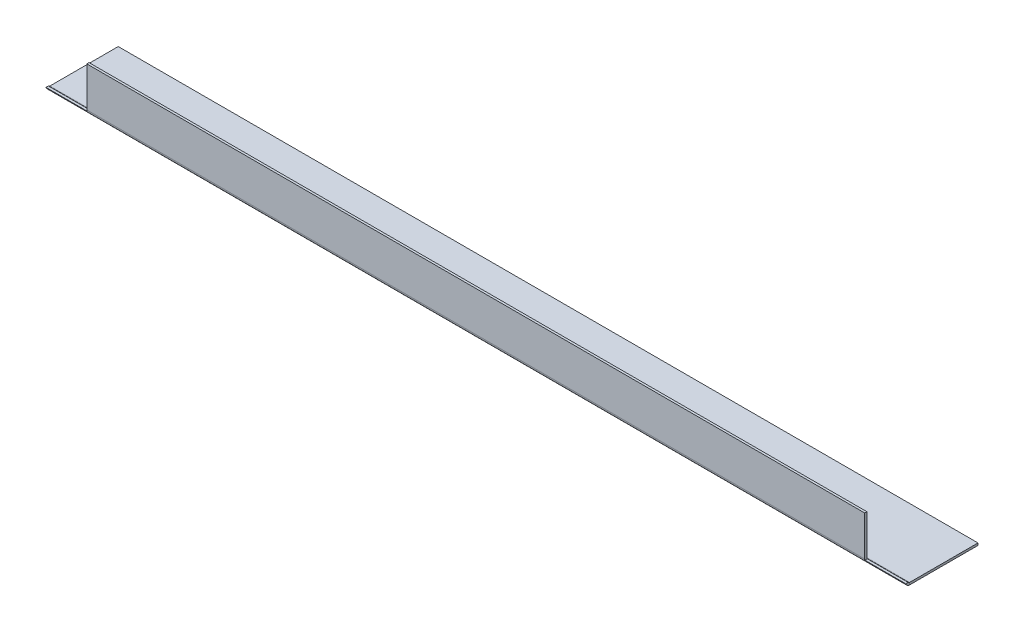
ISO-10303-21;
HEADER;
FILE_DESCRIPTION(('STEP AP214'),'2;1');
FILE_NAME('part.step','',(''),(''),'','','');
FILE_SCHEMA(('AUTOMOTIVE_DESIGN { 1 0 10303 214 1 1 1 1 }'));
ENDSEC;
DATA;
#1=APPLICATION_CONTEXT('core data for automotive mechanical design processes');
#2=APPLICATION_PROTOCOL_DEFINITION('international standard','automotive_design',2000,#1);
#3=PRODUCT_CONTEXT('',#1,'mechanical');
#4=PRODUCT('Part','Part','',(#3));
#5=PRODUCT_RELATED_PRODUCT_CATEGORY('part','',(#4));
#6=PRODUCT_DEFINITION_FORMATION('','',#4);
#7=PRODUCT_DEFINITION_CONTEXT('part definition',#1,'design');
#8=PRODUCT_DEFINITION('design','',#6,#7);
#9=PRODUCT_DEFINITION_SHAPE('','',#8);
#10=(LENGTH_UNIT() NAMED_UNIT(*) SI_UNIT(.MILLI.,.METRE.));
#11=(NAMED_UNIT(*) PLANE_ANGLE_UNIT() SI_UNIT($,.RADIAN.));
#12=(NAMED_UNIT(*) SI_UNIT($,.STERADIAN.) SOLID_ANGLE_UNIT());
#13=UNCERTAINTY_MEASURE_WITH_UNIT(LENGTH_MEASURE(1.E-05),#10,'distance_accuracy_value','');
#14=(GEOMETRIC_REPRESENTATION_CONTEXT(3) GLOBAL_UNCERTAINTY_ASSIGNED_CONTEXT((#13)) GLOBAL_UNIT_ASSIGNED_CONTEXT((#10,
#11,#12)) REPRESENTATION_CONTEXT('',''));
#15=CARTESIAN_POINT('',(0.,0.,0.));
#16=DIRECTION('',(0.,0.,1.));
#17=DIRECTION('',(1.,0.,0.));
#18=AXIS2_PLACEMENT_3D('',#15,#16,#17);
#19=CARTESIAN_POINT('',(0.,3.,93.5));
#20=DIRECTION('',(0.,-1.,0.));
#21=DIRECTION('',(1.,0.,0.));
#22=AXIS2_PLACEMENT_3D('',#19,#20,#21);
#23=PLANE('',#22);
#24=DIRECTION('',(-1.,0.,0.));
#25=VECTOR('',#24,1.);
#26=CARTESIAN_POINT('',(0.,3.,0.));
#27=LINE('',#26,#25);
#28=CARTESIAN_POINT('',(0.,3.,0.));
#29=VERTEX_POINT('',#28);
#30=CARTESIAN_POINT('',(-1176.,2.99999999999986,0.));
#31=VERTEX_POINT('',#30);
#32=EDGE_CURVE('E177',#29,#31,#27,.T.);
#33=ORIENTED_EDGE('',*,*,#32,.T.);
#34=DIRECTION('',(0.,0.,-1.));
#35=VECTOR('',#34,1.);
#36=CARTESIAN_POINT('',(-1176.,2.99999999999986,93.5));
#37=LINE('',#36,#35);
#38=CARTESIAN_POINT('',(-1176.,2.99999999999991,93.5));
#39=VERTEX_POINT('',#38);
#40=EDGE_CURVE('E210',#39,#31,#37,.T.);
#41=ORIENTED_EDGE('',*,*,#40,.F.);
#42=DIRECTION('',(-1.,0.,0.));
#43=VECTOR('',#42,1.);
#44=CARTESIAN_POINT('',(0.,3.,93.5));
#45=LINE('',#44,#43);
#46=CARTESIAN_POINT('',(0.,2.99999999999991,93.5));
#47=VERTEX_POINT('',#46);
#48=EDGE_CURVE('E182',#47,#39,#45,.T.);
#49=ORIENTED_EDGE('',*,*,#48,.F.);
#50=DIRECTION('',(0.,0.,-1.));
#51=VECTOR('',#50,1.);
#52=CARTESIAN_POINT('',(0.,3.,93.5));
#53=LINE('',#52,#51);
#54=EDGE_CURVE('E194',#47,#29,#53,.T.);
#55=ORIENTED_EDGE('',*,*,#54,.T.);
#56=EDGE_LOOP('',(#33,#41,#49,#55));
#57=FACE_BOUND('',#56,.T.);
#58=ADVANCED_FACE('F58',(#57),#23,.F.);
#59=CARTESIAN_POINT('',(-1176.,-1.44018463579729E-13,93.5));
#60=DIRECTION('',(-1.,0.,0.));
#61=DIRECTION('',(0.,0.,1.));
#62=AXIS2_PLACEMENT_3D('',#59,#60,#61);
#63=PLANE('',#62);
#64=DIRECTION('',(0.,1.,0.));
#65=VECTOR('',#64,1.);
#66=CARTESIAN_POINT('',(-1176.,-1.44018463579729E-13,0.));
#67=LINE('',#66,#65);
#68=CARTESIAN_POINT('',(-1176.,-1.44018463579729E-13,0.));
#69=VERTEX_POINT('',#68);
#70=EDGE_CURVE('E197',#69,#31,#67,.T.);
#71=ORIENTED_EDGE('',*,*,#70,.F.);
#72=DIRECTION('',(0.,0.,-1.));
#73=VECTOR('',#72,1.);
#74=CARTESIAN_POINT('',(-1176.,-1.44018463579729E-13,93.5));
#75=LINE('',#74,#73);
#76=CARTESIAN_POINT('',(-1176.,-1.44018463579729E-13,93.5));
#77=VERTEX_POINT('',#76);
#78=EDGE_CURVE('E208',#77,#69,#75,.T.);
#79=ORIENTED_EDGE('',*,*,#78,.F.);
#80=DIRECTION('',(0.,1.,0.));
#81=VECTOR('',#80,1.);
#82=CARTESIAN_POINT('',(-1176.,-1.44018463579729E-13,93.5));
#83=LINE('',#82,#81);
#84=EDGE_CURVE('E184',#77,#39,#83,.T.);
#85=ORIENTED_EDGE('',*,*,#84,.T.);
#86=ORIENTED_EDGE('',*,*,#40,.T.);
#87=EDGE_LOOP('',(#71,#79,#85,#86));
#88=FACE_BOUND('',#87,.T.);
#89=ADVANCED_FACE('F292',(#88),#63,.T.);
#90=CARTESIAN_POINT('',(0.,0.,93.5));
#91=DIRECTION('',(0.,-1.,0.));
#92=DIRECTION('',(1.,0.,0.));
#93=AXIS2_PLACEMENT_3D('',#90,#91,#92);
#94=PLANE('',#93);
#95=DIRECTION('',(-1.,0.,0.));
#96=VECTOR('',#95,1.);
#97=CARTESIAN_POINT('',(0.,0.,0.));
#98=LINE('',#97,#96);
#99=CARTESIAN_POINT('',(0.,0.,0.));
#100=VERTEX_POINT('',#99);
#101=EDGE_CURVE('E200',#100,#69,#98,.T.);
#102=ORIENTED_EDGE('',*,*,#101,.F.);
#103=DIRECTION('',(0.,0.,-1.));
#104=VECTOR('',#103,1.);
#105=CARTESIAN_POINT('',(0.,0.,93.5));
#106=LINE('',#105,#104);
#107=CARTESIAN_POINT('',(0.,0.,93.5));
#108=VERTEX_POINT('',#107);
#109=EDGE_CURVE('E206',#108,#100,#106,.T.);
#110=ORIENTED_EDGE('',*,*,#109,.F.);
#111=DIRECTION('',(-1.,0.,0.));
#112=VECTOR('',#111,1.);
#113=CARTESIAN_POINT('',(0.,0.,93.5));
#114=LINE('',#113,#112);
#115=EDGE_CURVE('E188',#108,#77,#114,.T.);
#116=ORIENTED_EDGE('',*,*,#115,.T.);
#117=ORIENTED_EDGE('',*,*,#78,.T.);
#118=EDGE_LOOP('',(#102,#110,#116,#117));
#119=FACE_BOUND('',#118,.T.);
#120=ADVANCED_FACE('F271',(#119),#94,.T.);
#121=CARTESIAN_POINT('',(0.,3.,93.5));
#122=DIRECTION('',(1.,0.,0.));
#123=DIRECTION('',(0.,1.,0.));
#124=AXIS2_PLACEMENT_3D('',#121,#122,#123);
#125=PLANE('',#124);
#126=DIRECTION('',(0.,-1.,0.));
#127=VECTOR('',#126,1.);
#128=CARTESIAN_POINT('',(0.,3.,0.));
#129=LINE('',#128,#127);
#130=EDGE_CURVE('E185',#29,#100,#129,.T.);
#131=ORIENTED_EDGE('',*,*,#130,.F.);
#132=ORIENTED_EDGE('',*,*,#54,.F.);
#133=DIRECTION('',(0.,-1.,0.));
#134=VECTOR('',#133,1.);
#135=CARTESIAN_POINT('',(0.,3.,93.5));
#136=LINE('',#135,#134);
#137=EDGE_CURVE('E191',#47,#108,#136,.T.);
#138=ORIENTED_EDGE('',*,*,#137,.T.);
#139=ORIENTED_EDGE('',*,*,#109,.T.);
#140=EDGE_LOOP('',(#131,#132,#138,#139));
#141=FACE_BOUND('',#140,.T.);
#142=ADVANCED_FACE('F275',(#141),#125,.T.);
#143=CARTESIAN_POINT('',(0.,0.,0.));
#144=DIRECTION('',(0.,0.,-1.));
#145=DIRECTION('',(-1.,0.,0.));
#146=AXIS2_PLACEMENT_3D('',#143,#144,#145);
#147=PLANE('',#146);
#148=ORIENTED_EDGE('',*,*,#32,.F.);
#149=ORIENTED_EDGE('',*,*,#130,.T.);
#150=ORIENTED_EDGE('',*,*,#101,.T.);
#151=ORIENTED_EDGE('',*,*,#70,.T.);
#152=EDGE_LOOP('',(#148,#149,#150,#151));
#153=FACE_BOUND('',#152,.T.);
#154=ADVANCED_FACE('F305',(#153),#147,.T.);
#155=CARTESIAN_POINT('',(-1176.,5.49999999999989,93.5));
#156=DIRECTION('',(-1.,0.,0.));
#157=DIRECTION('',(0.,0.,1.));
#158=AXIS2_PLACEMENT_3D('',#155,#156,#157);
#159=PLANE('',#158);
#160=DIRECTION('',(0.,0.,1.));
#161=VECTOR('',#160,1.);
#162=CARTESIAN_POINT('',(-1176.,4.00000000000001,89.));
#163=LINE('',#162,#161);
#164=CARTESIAN_POINT('',(-1176.,4.00000000000001,95.5000000000001));
#165=VERTEX_POINT('',#164);
#166=CARTESIAN_POINT('',(-1176.,4.00000000000001,98.7915026221292));
#167=VERTEX_POINT('',#166);
#168=EDGE_CURVE('E225',#165,#167,#163,.T.);
#169=ORIENTED_EDGE('',*,*,#168,.F.);
#170=CARTESIAN_POINT('',(-1176.,5.49999999999989,93.5));
#171=DIRECTION('',(1.,0.,0.));
#172=DIRECTION('',(0.,0.,-1.));
#173=AXIS2_PLACEMENT_3D('',#170,#171,#172);
#174=CIRCLE('',#173,2.49999999999999);
#175=EDGE_CURVE('E163',#39,#165,#174,.F.);
#176=ORIENTED_EDGE('',*,*,#175,.F.);
#177=ORIENTED_EDGE('',*,*,#84,.F.);
#178=CARTESIAN_POINT('',(-1176.,5.49999999999989,93.5));
#179=DIRECTION('',(1.,0.,0.));
#180=DIRECTION('',(0.,0.,-1.));
#181=AXIS2_PLACEMENT_3D('',#178,#179,#180);
#182=CIRCLE('',#181,5.49999999999999);
#183=EDGE_CURVE('E174',#77,#167,#182,.F.);
#184=ORIENTED_EDGE('',*,*,#183,.T.);
#185=EDGE_LOOP('',(#169,#176,#177,#184));
#186=FACE_BOUND('',#185,.T.);
#187=ADVANCED_FACE('F230',(#186),#159,.T.);
#188=CARTESIAN_POINT('',(0.,5.49999999999989,93.5));
#189=DIRECTION('',(-1.,0.,0.));
#190=DIRECTION('',(0.,0.,1.));
#191=AXIS2_PLACEMENT_3D('',#188,#189,#190);
#192=PLANE('',#191);
#193=DIRECTION('',(0.,0.,1.));
#194=VECTOR('',#193,1.);
#195=CARTESIAN_POINT('',(0.,4.,89.));
#196=LINE('',#195,#194);
#197=CARTESIAN_POINT('',(0.,4.,95.5000000000001));
#198=VERTEX_POINT('',#197);
#199=CARTESIAN_POINT('',(0.,4.,98.7915026221292));
#200=VERTEX_POINT('',#199);
#201=EDGE_CURVE('E259',#198,#200,#196,.T.);
#202=ORIENTED_EDGE('',*,*,#201,.T.);
#203=CARTESIAN_POINT('',(0.,5.49999999999989,93.5));
#204=DIRECTION('',(1.,0.,0.));
#205=DIRECTION('',(0.,0.,-1.));
#206=AXIS2_PLACEMENT_3D('',#203,#204,#205);
#207=CIRCLE('',#206,5.49999999999999);
#208=EDGE_CURVE('E178',#200,#108,#207,.T.);
#209=ORIENTED_EDGE('',*,*,#208,.T.);
#210=ORIENTED_EDGE('',*,*,#137,.F.);
#211=CARTESIAN_POINT('',(0.,5.49999999999989,93.5));
#212=DIRECTION('',(1.,0.,0.));
#213=DIRECTION('',(0.,0.,-1.));
#214=AXIS2_PLACEMENT_3D('',#211,#212,#213);
#215=CIRCLE('',#214,2.49999999999999);
#216=EDGE_CURVE('E160',#198,#47,#215,.T.);
#217=ORIENTED_EDGE('',*,*,#216,.F.);
#218=EDGE_LOOP('',(#202,#209,#210,#217));
#219=FACE_BOUND('',#218,.T.);
#220=ADVANCED_FACE('F264',(#219),#192,.F.);
#221=CARTESIAN_POINT('',(0.,5.49999999999989,93.5));
#222=DIRECTION('',(1.,0.,0.));
#223=DIRECTION('',(0.,0.,1.));
#224=AXIS2_PLACEMENT_3D('',#221,#222,#223);
#225=CYLINDRICAL_SURFACE('',#224,5.49999999999999);
#226=DIRECTION('',(1.,0.,0.));
#227=VECTOR('',#226,1.);
#228=CARTESIAN_POINT('',(0.,4.,98.7915026221292));
#229=LINE('',#228,#227);
#230=CARTESIAN_POINT('',(-56.,4.,98.7915026221292));
#231=VERTEX_POINT('',#230);
#232=EDGE_CURVE('E237',#231,#200,#229,.T.);
#233=ORIENTED_EDGE('',*,*,#232,.F.);
#234=CARTESIAN_POINT('',(-56.,5.49999999999989,93.5));
#235=DIRECTION('',(-1.,0.,0.));
#236=DIRECTION('',(0.,0.,1.));
#237=AXIS2_PLACEMENT_3D('',#234,#235,#236);
#238=CIRCLE('',#237,5.49999999999999);
#239=CARTESIAN_POINT('',(-56.,5.49999999999985,99.));
#240=VERTEX_POINT('',#239);
#241=EDGE_CURVE('E249',#240,#231,#238,.F.);
#242=ORIENTED_EDGE('',*,*,#241,.F.);
#243=DIRECTION('',(1.,0.,0.));
#244=VECTOR('',#243,1.);
#245=CARTESIAN_POINT('',(-1176.,5.49999999999984,99.));
#246=LINE('',#245,#244);
#247=CARTESIAN_POINT('',(-1120.,5.49999999999984,99.));
#248=VERTEX_POINT('',#247);
#249=EDGE_CURVE('E153',#240,#248,#246,.F.);
#250=ORIENTED_EDGE('',*,*,#249,.T.);
#251=CARTESIAN_POINT('',(-1120.,5.49999999999989,93.5));
#252=DIRECTION('',(1.,0.,0.));
#253=DIRECTION('',(0.,0.,-1.));
#254=AXIS2_PLACEMENT_3D('',#251,#252,#253);
#255=CIRCLE('',#254,5.49999999999999);
#256=CARTESIAN_POINT('',(-1120.,4.00000000000001,98.7915026221292));
#257=VERTEX_POINT('',#256);
#258=EDGE_CURVE('E241',#257,#248,#255,.F.);
#259=ORIENTED_EDGE('',*,*,#258,.F.);
#260=DIRECTION('',(1.,0.,0.));
#261=VECTOR('',#260,1.);
#262=CARTESIAN_POINT('',(0.,4.00000000000001,98.7915026221292));
#263=LINE('',#262,#261);
#264=EDGE_CURVE('E167',#167,#257,#263,.T.);
#265=ORIENTED_EDGE('',*,*,#264,.F.);
#266=ORIENTED_EDGE('',*,*,#183,.F.);
#267=ORIENTED_EDGE('',*,*,#115,.F.);
#268=ORIENTED_EDGE('',*,*,#208,.F.);
#269=EDGE_LOOP('',(#233,#242,#250,#259,#265,#266,#267,#268));
#270=FACE_BOUND('',#269,.T.);
#271=ADVANCED_FACE('F248',(#270),#225,.T.);
#272=CARTESIAN_POINT('',(0.,5.49999999999989,93.5));
#273=DIRECTION('',(1.,0.,0.));
#274=DIRECTION('',(0.,0.,1.));
#275=AXIS2_PLACEMENT_3D('',#272,#273,#274);
#276=CYLINDRICAL_SURFACE('',#275,2.49999999999999);
#277=CARTESIAN_POINT('',(-56.,5.49999999999989,93.5));
#278=DIRECTION('',(-1.,0.,0.));
#279=DIRECTION('',(0.,0.,1.));
#280=AXIS2_PLACEMENT_3D('',#277,#278,#279);
#281=CIRCLE('',#280,2.49999999999999);
#282=CARTESIAN_POINT('',(-56.,5.49999999999984,96.));
#283=VERTEX_POINT('',#282);
#284=CARTESIAN_POINT('',(-56.,4.,95.5000000000001));
#285=VERTEX_POINT('',#284);
#286=EDGE_CURVE('E253',#283,#285,#281,.F.);
#287=ORIENTED_EDGE('',*,*,#286,.T.);
#288=DIRECTION('',(1.,0.,0.));
#289=VECTOR('',#288,1.);
#290=CARTESIAN_POINT('',(0.,4.,95.5000000000001));
#291=LINE('',#290,#289);
#292=EDGE_CURVE('E13',#285,#198,#291,.T.);
#293=ORIENTED_EDGE('',*,*,#292,.T.);
#294=ORIENTED_EDGE('',*,*,#216,.T.);
#295=ORIENTED_EDGE('',*,*,#48,.T.);
#296=ORIENTED_EDGE('',*,*,#175,.T.);
#297=DIRECTION('',(1.,0.,0.));
#298=VECTOR('',#297,1.);
#299=CARTESIAN_POINT('',(0.,4.00000000000001,95.5000000000001));
#300=LINE('',#299,#298);
#301=CARTESIAN_POINT('',(-1120.,4.00000000000001,95.5000000000001));
#302=VERTEX_POINT('',#301);
#303=EDGE_CURVE('E150',#165,#302,#300,.T.);
#304=ORIENTED_EDGE('',*,*,#303,.T.);
#305=CARTESIAN_POINT('',(-1120.,5.49999999999989,93.5));
#306=DIRECTION('',(1.,0.,0.));
#307=DIRECTION('',(0.,0.,-1.));
#308=AXIS2_PLACEMENT_3D('',#305,#306,#307);
#309=CIRCLE('',#308,2.49999999999999);
#310=CARTESIAN_POINT('',(-1120.,5.49999999999984,96.));
#311=VERTEX_POINT('',#310);
#312=EDGE_CURVE('E218',#302,#311,#309,.F.);
#313=ORIENTED_EDGE('',*,*,#312,.T.);
#314=DIRECTION('',(1.,0.,0.));
#315=VECTOR('',#314,1.);
#316=CARTESIAN_POINT('',(-1176.,5.49999999999984,96.));
#317=LINE('',#316,#315);
#318=EDGE_CURVE('E171',#311,#283,#317,.T.);
#319=ORIENTED_EDGE('',*,*,#318,.T.);
#320=EDGE_LOOP('',(#287,#293,#294,#295,#296,#304,#313,#319));
#321=FACE_BOUND('',#320,.T.);
#322=ADVANCED_FACE('F217',(#321),#276,.F.);
#323=CARTESIAN_POINT('',(0.,0.,99.));
#324=DIRECTION('',(0.,0.,-1.));
#325=DIRECTION('',(-1.,0.,0.));
#326=AXIS2_PLACEMENT_3D('',#323,#324,#325);
#327=PLANE('',#326);
#328=ORIENTED_EDGE('',*,*,#249,.F.);
#329=DIRECTION('',(0.,-1.,0.));
#330=VECTOR('',#329,1.);
#331=CARTESIAN_POINT('',(-56.,60.,99.));
#332=LINE('',#331,#330);
#333=CARTESIAN_POINT('',(-56.,60.,99.));
#334=VERTEX_POINT('',#333);
#335=EDGE_CURVE('E146',#334,#240,#332,.T.);
#336=ORIENTED_EDGE('',*,*,#335,.F.);
#337=DIRECTION('',(-1.,0.,0.));
#338=VECTOR('',#337,1.);
#339=CARTESIAN_POINT('',(0.,60.,99.));
#340=LINE('',#339,#338);
#341=CARTESIAN_POINT('',(-1120.,60.,99.));
#342=VERTEX_POINT('',#341);
#343=EDGE_CURVE('E80',#334,#342,#340,.T.);
#344=ORIENTED_EDGE('',*,*,#343,.T.);
#345=DIRECTION('',(0.,1.,0.));
#346=VECTOR('',#345,1.);
#347=CARTESIAN_POINT('',(-1120.,60.,99.));
#348=LINE('',#347,#346);
#349=EDGE_CURVE('E233',#248,#342,#348,.T.);
#350=ORIENTED_EDGE('',*,*,#349,.F.);
#351=EDGE_LOOP('',(#328,#336,#344,#350));
#352=FACE_BOUND('',#351,.T.);
#353=ADVANCED_FACE('F152',(#352),#327,.F.);
#354=CARTESIAN_POINT('',(0.,0.,96.));
#355=DIRECTION('',(0.,0.,-1.));
#356=DIRECTION('',(-1.,0.,0.));
#357=AXIS2_PLACEMENT_3D('',#354,#355,#356);
#358=PLANE('',#357);
#359=DIRECTION('',(0.,1.,0.));
#360=VECTOR('',#359,1.);
#361=CARTESIAN_POINT('',(-56.,0.,96.));
#362=LINE('',#361,#360);
#363=CARTESIAN_POINT('',(-56.,60.,96.));
#364=VERTEX_POINT('',#363);
#365=EDGE_CURVE('E72',#283,#364,#362,.T.);
#366=ORIENTED_EDGE('',*,*,#365,.F.);
#367=ORIENTED_EDGE('',*,*,#318,.F.);
#368=DIRECTION('',(0.,-1.,0.));
#369=VECTOR('',#368,1.);
#370=CARTESIAN_POINT('',(-1120.,0.,96.));
#371=LINE('',#370,#369);
#372=CARTESIAN_POINT('',(-1120.,60.,96.));
#373=VERTEX_POINT('',#372);
#374=EDGE_CURVE('E235',#373,#311,#371,.T.);
#375=ORIENTED_EDGE('',*,*,#374,.F.);
#376=DIRECTION('',(1.,0.,0.));
#377=VECTOR('',#376,1.);
#378=CARTESIAN_POINT('',(-1176.,60.,96.));
#379=LINE('',#378,#377);
#380=EDGE_CURVE('E161',#364,#373,#379,.F.);
#381=ORIENTED_EDGE('',*,*,#380,.F.);
#382=EDGE_LOOP('',(#366,#367,#375,#381));
#383=FACE_BOUND('',#382,.T.);
#384=ADVANCED_FACE('F281',(#383),#358,.T.);
#385=CARTESIAN_POINT('',(-1176.,60.,99.));
#386=DIRECTION('',(0.,-1.,0.));
#387=DIRECTION('',(0.,0.,-1.));
#388=AXIS2_PLACEMENT_3D('',#385,#386,#387);
#389=PLANE('',#388);
#390=ORIENTED_EDGE('',*,*,#343,.F.);
#391=DIRECTION('',(0.,0.,-1.));
#392=VECTOR('',#391,1.);
#393=CARTESIAN_POINT('',(-56.,60.,99.));
#394=LINE('',#393,#392);
#395=EDGE_CURVE('E65',#334,#364,#394,.T.);
#396=ORIENTED_EDGE('',*,*,#395,.T.);
#397=ORIENTED_EDGE('',*,*,#380,.T.);
#398=DIRECTION('',(0.,0.,1.));
#399=VECTOR('',#398,1.);
#400=CARTESIAN_POINT('',(-1120.,60.,99.));
#401=LINE('',#400,#399);
#402=EDGE_CURVE('E159',#373,#342,#401,.T.);
#403=ORIENTED_EDGE('',*,*,#402,.T.);
#404=EDGE_LOOP('',(#390,#396,#397,#403));
#405=FACE_BOUND('',#404,.T.);
#406=ADVANCED_FACE('F157',(#405),#389,.F.);
#407=CARTESIAN_POINT('',(-1176.,4.00000000000001,89.));
#408=DIRECTION('',(0.,-1.,0.));
#409=DIRECTION('',(0.,0.,-1.));
#410=AXIS2_PLACEMENT_3D('',#407,#408,#409);
#411=PLANE('',#410);
#412=ORIENTED_EDGE('',*,*,#264,.T.);
#413=DIRECTION('',(0.,0.,1.));
#414=VECTOR('',#413,1.);
#415=CARTESIAN_POINT('',(-1120.,4.00000000000001,89.));
#416=LINE('',#415,#414);
#417=EDGE_CURVE('E228',#302,#257,#416,.T.);
#418=ORIENTED_EDGE('',*,*,#417,.F.);
#419=ORIENTED_EDGE('',*,*,#303,.F.);
#420=ORIENTED_EDGE('',*,*,#168,.T.);
#421=EDGE_LOOP('',(#412,#418,#419,#420));
#422=FACE_BOUND('',#421,.T.);
#423=ADVANCED_FACE('F224',(#422),#411,.F.);
#424=CARTESIAN_POINT('',(-1120.,60.,89.));
#425=DIRECTION('',(1.,0.,0.));
#426=DIRECTION('',(0.,0.,-1.));
#427=AXIS2_PLACEMENT_3D('',#424,#425,#426);
#428=PLANE('',#427);
#429=ORIENTED_EDGE('',*,*,#258,.T.);
#430=ORIENTED_EDGE('',*,*,#349,.T.);
#431=ORIENTED_EDGE('',*,*,#402,.F.);
#432=ORIENTED_EDGE('',*,*,#374,.T.);
#433=ORIENTED_EDGE('',*,*,#312,.F.);
#434=ORIENTED_EDGE('',*,*,#417,.T.);
#435=EDGE_LOOP('',(#429,#430,#431,#432,#433,#434));
#436=FACE_BOUND('',#435,.T.);
#437=ADVANCED_FACE('F246',(#436),#428,.F.);
#438=CARTESIAN_POINT('',(0.,4.,89.));
#439=DIRECTION('',(0.,-1.,0.));
#440=DIRECTION('',(1.,0.,0.));
#441=AXIS2_PLACEMENT_3D('',#438,#439,#440);
#442=PLANE('',#441);
#443=ORIENTED_EDGE('',*,*,#232,.T.);
#444=ORIENTED_EDGE('',*,*,#201,.F.);
#445=ORIENTED_EDGE('',*,*,#292,.F.);
#446=DIRECTION('',(0.,0.,1.));
#447=VECTOR('',#446,1.);
#448=CARTESIAN_POINT('',(-56.,4.,89.));
#449=LINE('',#448,#447);
#450=EDGE_CURVE('E154',#285,#231,#449,.T.);
#451=ORIENTED_EDGE('',*,*,#450,.T.);
#452=EDGE_LOOP('',(#443,#444,#445,#451));
#453=FACE_BOUND('',#452,.T.);
#454=ADVANCED_FACE('F279',(#453),#442,.F.);
#455=CARTESIAN_POINT('',(-56.,60.,89.));
#456=DIRECTION('',(-1.,0.,0.));
#457=DIRECTION('',(0.,0.,1.));
#458=AXIS2_PLACEMENT_3D('',#455,#456,#457);
#459=PLANE('',#458);
#460=ORIENTED_EDGE('',*,*,#241,.T.);
#461=ORIENTED_EDGE('',*,*,#450,.F.);
#462=ORIENTED_EDGE('',*,*,#286,.F.);
#463=ORIENTED_EDGE('',*,*,#365,.T.);
#464=ORIENTED_EDGE('',*,*,#395,.F.);
#465=ORIENTED_EDGE('',*,*,#335,.T.);
#466=EDGE_LOOP('',(#460,#461,#462,#463,#464,#465));
#467=FACE_BOUND('',#466,.T.);
#468=ADVANCED_FACE('F145',(#467),#459,.F.);
#469=CLOSED_SHELL('',(#58,#89,#120,#142,#154,#187,#220,#271,#322,#353,#384,#406,#423,#437,#454,#468));
#470=MANIFOLD_SOLID_BREP('B2',#469);
#471=ADVANCED_BREP_SHAPE_REPRESENTATION('',(#18,#470),#14);
#472=SHAPE_DEFINITION_REPRESENTATION(#9,#471);
ENDSEC;
END-ISO-10303-21;
